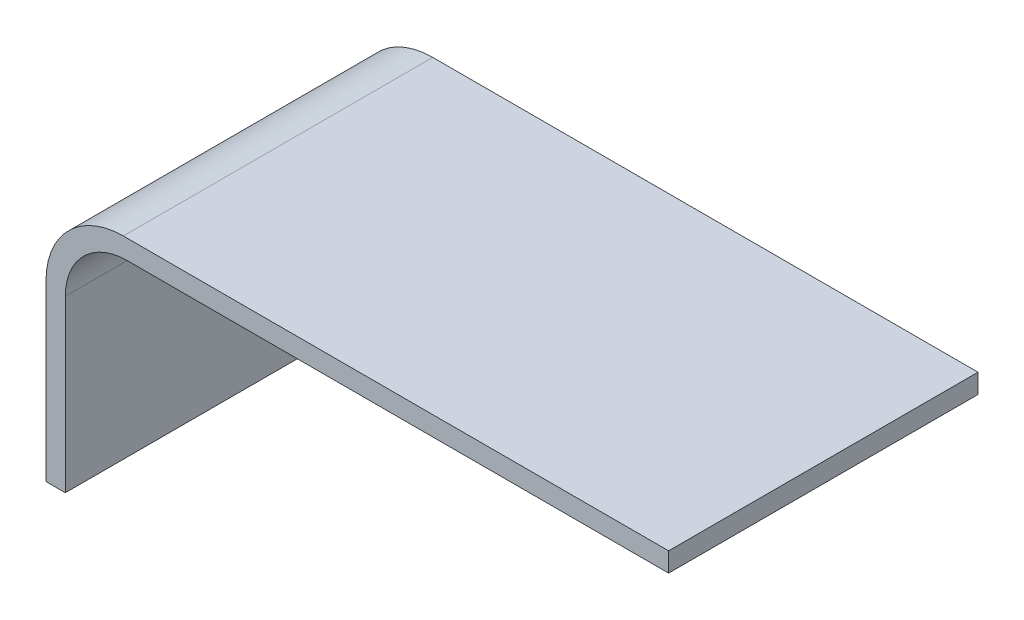
ISO-10303-21;
HEADER;
FILE_DESCRIPTION(('STEP AP214'),'2;1');
FILE_NAME('part.step','',(''),(''),'','','');
FILE_SCHEMA(('AUTOMOTIVE_DESIGN { 1 0 10303 214 1 1 1 1 }'));
ENDSEC;
DATA;
#1=APPLICATION_CONTEXT('core data for automotive mechanical design processes');
#2=APPLICATION_PROTOCOL_DEFINITION('international standard','automotive_design',2000,#1);
#3=PRODUCT_CONTEXT('',#1,'mechanical');
#4=PRODUCT('Part','Part','',(#3));
#5=PRODUCT_RELATED_PRODUCT_CATEGORY('part','',(#4));
#6=PRODUCT_DEFINITION_FORMATION('','',#4);
#7=PRODUCT_DEFINITION_CONTEXT('part definition',#1,'design');
#8=PRODUCT_DEFINITION('design','',#6,#7);
#9=PRODUCT_DEFINITION_SHAPE('','',#8);
#10=(LENGTH_UNIT() NAMED_UNIT(*) SI_UNIT(.MILLI.,.METRE.));
#11=(NAMED_UNIT(*) PLANE_ANGLE_UNIT() SI_UNIT($,.RADIAN.));
#12=(NAMED_UNIT(*) SI_UNIT($,.STERADIAN.) SOLID_ANGLE_UNIT());
#13=UNCERTAINTY_MEASURE_WITH_UNIT(LENGTH_MEASURE(1.E-05),#10,'distance_accuracy_value','');
#14=(GEOMETRIC_REPRESENTATION_CONTEXT(3) GLOBAL_UNCERTAINTY_ASSIGNED_CONTEXT((#13)) GLOBAL_UNIT_ASSIGNED_CONTEXT((#10,
#11,#12)) REPRESENTATION_CONTEXT('',''));
#15=CARTESIAN_POINT('',(0.,0.,0.));
#16=DIRECTION('',(0.,0.,1.));
#17=DIRECTION('',(1.,0.,0.));
#18=AXIS2_PLACEMENT_3D('',#15,#16,#17);
#19=CARTESIAN_POINT('',(204.47,0.,101.6));
#20=DIRECTION('',(-1.,0.,0.));
#21=DIRECTION('',(0.,0.,1.));
#22=AXIS2_PLACEMENT_3D('',#19,#20,#21);
#23=PLANE('',#22);
#24=DIRECTION('',(0.,1.,0.));
#25=VECTOR('',#24,1.);
#26=CARTESIAN_POINT('',(204.47,0.,0.));
#27=LINE('',#26,#25);
#28=CARTESIAN_POINT('',(204.47,-6.35,0.));
#29=VERTEX_POINT('',#28);
#30=CARTESIAN_POINT('',(204.47,0.,0.));
#31=VERTEX_POINT('',#30);
#32=EDGE_CURVE('E145',#29,#31,#27,.T.);
#33=ORIENTED_EDGE('',*,*,#32,.T.);
#34=DIRECTION('',(0.,0.,-1.));
#35=VECTOR('',#34,1.);
#36=CARTESIAN_POINT('',(204.47,0.,101.6));
#37=LINE('',#36,#35);
#38=CARTESIAN_POINT('',(204.47,0.,101.6));
#39=VERTEX_POINT('',#38);
#40=EDGE_CURVE('E11',#39,#31,#37,.T.);
#41=ORIENTED_EDGE('',*,*,#40,.F.);
#42=DIRECTION('',(0.,1.,0.));
#43=VECTOR('',#42,1.);
#44=CARTESIAN_POINT('',(204.47,0.,101.6));
#45=LINE('',#44,#43);
#46=CARTESIAN_POINT('',(204.47,-6.35,101.6));
#47=VERTEX_POINT('',#46);
#48=EDGE_CURVE('E167',#47,#39,#45,.T.);
#49=ORIENTED_EDGE('',*,*,#48,.F.);
#50=DIRECTION('',(0.,0.,-1.));
#51=VECTOR('',#50,1.);
#52=CARTESIAN_POINT('',(204.47,-6.35,101.6));
#53=LINE('',#52,#51);
#54=EDGE_CURVE('E141',#47,#29,#53,.T.);
#55=ORIENTED_EDGE('',*,*,#54,.T.);
#56=EDGE_LOOP('',(#33,#41,#49,#55));
#57=FACE_BOUND('',#56,.T.);
#58=ADVANCED_FACE('F44',(#57),#23,.F.);
#59=CARTESIAN_POINT('',(25.4000000000002,0.,101.6));
#60=DIRECTION('',(0.,-1.,0.));
#61=DIRECTION('',(1.,0.,0.));
#62=AXIS2_PLACEMENT_3D('',#59,#60,#61);
#63=PLANE('',#62);
#64=DIRECTION('',(-1.,0.,0.));
#65=VECTOR('',#64,1.);
#66=CARTESIAN_POINT('',(25.4000000000002,0.,0.));
#67=LINE('',#66,#65);
#68=CARTESIAN_POINT('',(25.4000000000002,0.,0.));
#69=VERTEX_POINT('',#68);
#70=EDGE_CURVE('E149',#31,#69,#67,.T.);
#71=ORIENTED_EDGE('',*,*,#70,.T.);
#72=DIRECTION('',(0.,0.,-1.));
#73=VECTOR('',#72,1.);
#74=CARTESIAN_POINT('',(25.4000000000002,0.,101.6));
#75=LINE('',#74,#73);
#76=CARTESIAN_POINT('',(25.4000000000002,0.,101.6));
#77=VERTEX_POINT('',#76);
#78=EDGE_CURVE('E53',#77,#69,#75,.T.);
#79=ORIENTED_EDGE('',*,*,#78,.F.);
#80=DIRECTION('',(-1.,0.,0.));
#81=VECTOR('',#80,1.);
#82=CARTESIAN_POINT('',(25.4000000000002,0.,101.6));
#83=LINE('',#82,#81);
#84=EDGE_CURVE('E104',#39,#77,#83,.T.);
#85=ORIENTED_EDGE('',*,*,#84,.F.);
#86=ORIENTED_EDGE('',*,*,#40,.T.);
#87=EDGE_LOOP('',(#71,#79,#85,#86));
#88=FACE_BOUND('',#87,.T.);
#89=ADVANCED_FACE('F213',(#88),#63,.F.);
#90=CARTESIAN_POINT('',(25.4,-25.4,101.6));
#91=DIRECTION('',(0.,0.,-1.));
#92=DIRECTION('',(-1.,0.,0.));
#93=AXIS2_PLACEMENT_3D('',#90,#91,#92);
#94=CYLINDRICAL_SURFACE('',#93,25.4);
#95=CARTESIAN_POINT('',(25.4,-25.4,0.));
#96=DIRECTION('',(0.,0.,1.));
#97=DIRECTION('',(-1.,0.,0.));
#98=AXIS2_PLACEMENT_3D('',#95,#96,#97);
#99=CIRCLE('',#98,25.4);
#100=CARTESIAN_POINT('',(0.,-25.4000000000002,0.));
#101=VERTEX_POINT('',#100);
#102=EDGE_CURVE('E152',#69,#101,#99,.T.);
#103=ORIENTED_EDGE('',*,*,#102,.T.);
#104=DIRECTION('',(0.,0.,-1.));
#105=VECTOR('',#104,1.);
#106=CARTESIAN_POINT('',(0.,-25.4000000000002,101.6));
#107=LINE('',#106,#105);
#108=CARTESIAN_POINT('',(0.,-25.4000000000002,101.6));
#109=VERTEX_POINT('',#108);
#110=EDGE_CURVE('E178',#109,#101,#107,.T.);
#111=ORIENTED_EDGE('',*,*,#110,.F.);
#112=CARTESIAN_POINT('',(25.4,-25.4,101.6));
#113=DIRECTION('',(0.,0.,1.));
#114=DIRECTION('',(-1.,0.,0.));
#115=AXIS2_PLACEMENT_3D('',#112,#113,#114);
#116=CIRCLE('',#115,25.4);
#117=EDGE_CURVE('E188',#77,#109,#116,.T.);
#118=ORIENTED_EDGE('',*,*,#117,.F.);
#119=ORIENTED_EDGE('',*,*,#78,.T.);
#120=EDGE_LOOP('',(#103,#111,#118,#119));
#121=FACE_BOUND('',#120,.T.);
#122=ADVANCED_FACE('F186',(#121),#94,.T.);
#123=CARTESIAN_POINT('',(0.,-82.55,101.6));
#124=DIRECTION('',(1.,0.,0.));
#125=DIRECTION('',(0.,1.,0.));
#126=AXIS2_PLACEMENT_3D('',#123,#124,#125);
#127=PLANE('',#126);
#128=DIRECTION('',(0.,-1.,0.));
#129=VECTOR('',#128,1.);
#130=CARTESIAN_POINT('',(0.,-82.55,0.));
#131=LINE('',#130,#129);
#132=CARTESIAN_POINT('',(0.,-82.55,0.));
#133=VERTEX_POINT('',#132);
#134=EDGE_CURVE('E155',#101,#133,#131,.T.);
#135=ORIENTED_EDGE('',*,*,#134,.T.);
#136=DIRECTION('',(0.,0.,-1.));
#137=VECTOR('',#136,1.);
#138=CARTESIAN_POINT('',(0.,-82.55,101.6));
#139=LINE('',#138,#137);
#140=CARTESIAN_POINT('',(0.,-82.55,101.6));
#141=VERTEX_POINT('',#140);
#142=EDGE_CURVE('E174',#141,#133,#139,.T.);
#143=ORIENTED_EDGE('',*,*,#142,.F.);
#144=DIRECTION('',(0.,-1.,0.));
#145=VECTOR('',#144,1.);
#146=CARTESIAN_POINT('',(0.,-82.55,101.6));
#147=LINE('',#146,#145);
#148=EDGE_CURVE('E201',#109,#141,#147,.T.);
#149=ORIENTED_EDGE('',*,*,#148,.F.);
#150=ORIENTED_EDGE('',*,*,#110,.T.);
#151=EDGE_LOOP('',(#135,#143,#149,#150));
#152=FACE_BOUND('',#151,.T.);
#153=ADVANCED_FACE('F196',(#152),#127,.F.);
#154=CARTESIAN_POINT('',(6.35000000000002,-82.55,101.6));
#155=DIRECTION('',(0.,1.,0.));
#156=DIRECTION('',(0.,0.,1.));
#157=AXIS2_PLACEMENT_3D('',#154,#155,#156);
#158=PLANE('',#157);
#159=DIRECTION('',(1.,0.,0.));
#160=VECTOR('',#159,1.);
#161=CARTESIAN_POINT('',(6.35000000000002,-82.55,0.));
#162=LINE('',#161,#160);
#163=CARTESIAN_POINT('',(6.35000000000002,-82.55,0.));
#164=VERTEX_POINT('',#163);
#165=EDGE_CURVE('E158',#133,#164,#162,.T.);
#166=ORIENTED_EDGE('',*,*,#165,.T.);
#167=DIRECTION('',(0.,0.,-1.));
#168=VECTOR('',#167,1.);
#169=CARTESIAN_POINT('',(6.35000000000002,-82.55,101.6));
#170=LINE('',#169,#168);
#171=CARTESIAN_POINT('',(6.35000000000002,-82.55,101.6));
#172=VERTEX_POINT('',#171);
#173=EDGE_CURVE('E134',#172,#164,#170,.T.);
#174=ORIENTED_EDGE('',*,*,#173,.F.);
#175=DIRECTION('',(1.,0.,0.));
#176=VECTOR('',#175,1.);
#177=CARTESIAN_POINT('',(6.35000000000002,-82.55,101.6));
#178=LINE('',#177,#176);
#179=EDGE_CURVE('E123',#141,#172,#178,.T.);
#180=ORIENTED_EDGE('',*,*,#179,.F.);
#181=ORIENTED_EDGE('',*,*,#142,.T.);
#182=EDGE_LOOP('',(#166,#174,#180,#181));
#183=FACE_BOUND('',#182,.T.);
#184=ADVANCED_FACE('F199',(#183),#158,.F.);
#185=CARTESIAN_POINT('',(6.35,-26.67,101.6));
#186=DIRECTION('',(-1.,0.,0.));
#187=DIRECTION('',(0.,-1.,0.));
#188=AXIS2_PLACEMENT_3D('',#185,#186,#187);
#189=PLANE('',#188);
#190=DIRECTION('',(0.,1.,0.));
#191=VECTOR('',#190,1.);
#192=CARTESIAN_POINT('',(6.35,-26.67,0.));
#193=LINE('',#192,#191);
#194=CARTESIAN_POINT('',(6.35,-26.67,0.));
#195=VERTEX_POINT('',#194);
#196=EDGE_CURVE('E132',#164,#195,#193,.T.);
#197=ORIENTED_EDGE('',*,*,#196,.T.);
#198=DIRECTION('',(0.,0.,-1.));
#199=VECTOR('',#198,1.);
#200=CARTESIAN_POINT('',(6.35,-26.67,101.6));
#201=LINE('',#200,#199);
#202=CARTESIAN_POINT('',(6.35,-26.67,101.6));
#203=VERTEX_POINT('',#202);
#204=EDGE_CURVE('E129',#203,#195,#201,.T.);
#205=ORIENTED_EDGE('',*,*,#204,.F.);
#206=DIRECTION('',(0.,1.,0.));
#207=VECTOR('',#206,1.);
#208=CARTESIAN_POINT('',(6.35,-26.67,101.6));
#209=LINE('',#208,#207);
#210=EDGE_CURVE('E117',#172,#203,#209,.T.);
#211=ORIENTED_EDGE('',*,*,#210,.F.);
#212=ORIENTED_EDGE('',*,*,#173,.T.);
#213=EDGE_LOOP('',(#197,#205,#211,#212));
#214=FACE_BOUND('',#213,.T.);
#215=ADVANCED_FACE('F130',(#214),#189,.F.);
#216=CARTESIAN_POINT('',(26.67,-26.67,101.6));
#217=DIRECTION('',(0.,0.,-1.));
#218=DIRECTION('',(-1.,0.,0.));
#219=AXIS2_PLACEMENT_3D('',#216,#217,#218);
#220=CYLINDRICAL_SURFACE('',#219,20.32);
#221=CARTESIAN_POINT('',(26.67,-26.67,0.));
#222=DIRECTION('',(0.,0.,-1.));
#223=DIRECTION('',(-1.,0.,0.));
#224=AXIS2_PLACEMENT_3D('',#221,#222,#223);
#225=CIRCLE('',#224,20.32);
#226=CARTESIAN_POINT('',(26.67,-6.35000000000003,0.));
#227=VERTEX_POINT('',#226);
#228=EDGE_CURVE('E90',#195,#227,#225,.T.);
#229=ORIENTED_EDGE('',*,*,#228,.T.);
#230=DIRECTION('',(0.,0.,-1.));
#231=VECTOR('',#230,1.);
#232=CARTESIAN_POINT('',(26.67,-6.35000000000003,101.6));
#233=LINE('',#232,#231);
#234=CARTESIAN_POINT('',(26.67,-6.35000000000003,101.6));
#235=VERTEX_POINT('',#234);
#236=EDGE_CURVE('E135',#235,#227,#233,.T.);
#237=ORIENTED_EDGE('',*,*,#236,.F.);
#238=CARTESIAN_POINT('',(26.67,-26.67,101.6));
#239=DIRECTION('',(0.,0.,-1.));
#240=DIRECTION('',(-1.,0.,0.));
#241=AXIS2_PLACEMENT_3D('',#238,#239,#240);
#242=CIRCLE('',#241,20.32);
#243=EDGE_CURVE('E121',#203,#235,#242,.T.);
#244=ORIENTED_EDGE('',*,*,#243,.F.);
#245=ORIENTED_EDGE('',*,*,#204,.T.);
#246=EDGE_LOOP('',(#229,#237,#244,#245));
#247=FACE_BOUND('',#246,.T.);
#248=ADVANCED_FACE('F137',(#247),#220,.F.);
#249=CARTESIAN_POINT('',(204.47,-6.35,101.6));
#250=DIRECTION('',(0.,1.,0.));
#251=DIRECTION('',(-1.,0.,0.));
#252=AXIS2_PLACEMENT_3D('',#249,#250,#251);
#253=PLANE('',#252);
#254=DIRECTION('',(1.,0.,0.));
#255=VECTOR('',#254,1.);
#256=CARTESIAN_POINT('',(204.47,-6.35,0.));
#257=LINE('',#256,#255);
#258=EDGE_CURVE('E96',#227,#29,#257,.T.);
#259=ORIENTED_EDGE('',*,*,#258,.T.);
#260=ORIENTED_EDGE('',*,*,#54,.F.);
#261=DIRECTION('',(1.,0.,0.));
#262=VECTOR('',#261,1.);
#263=CARTESIAN_POINT('',(204.47,-6.35,101.6));
#264=LINE('',#263,#262);
#265=EDGE_CURVE('E61',#235,#47,#264,.T.);
#266=ORIENTED_EDGE('',*,*,#265,.F.);
#267=ORIENTED_EDGE('',*,*,#236,.T.);
#268=EDGE_LOOP('',(#259,#260,#266,#267));
#269=FACE_BOUND('',#268,.T.);
#270=ADVANCED_FACE('F229',(#269),#253,.F.);
#271=CARTESIAN_POINT('',(26.67,-26.67,101.6));
#272=DIRECTION('',(0.,0.,-1.));
#273=DIRECTION('',(-1.,0.,0.));
#274=AXIS2_PLACEMENT_3D('',#271,#272,#273);
#275=PLANE('',#274);
#276=ORIENTED_EDGE('',*,*,#48,.T.);
#277=ORIENTED_EDGE('',*,*,#84,.T.);
#278=ORIENTED_EDGE('',*,*,#117,.T.);
#279=ORIENTED_EDGE('',*,*,#148,.T.);
#280=ORIENTED_EDGE('',*,*,#179,.T.);
#281=ORIENTED_EDGE('',*,*,#210,.T.);
#282=ORIENTED_EDGE('',*,*,#243,.T.);
#283=ORIENTED_EDGE('',*,*,#265,.T.);
#284=EDGE_LOOP('',(#276,#277,#278,#279,#280,#281,#282,#283));
#285=FACE_BOUND('',#284,.T.);
#286=ADVANCED_FACE('F119',(#285),#275,.F.);
#287=CARTESIAN_POINT('',(26.67,-26.67,0.));
#288=DIRECTION('',(0.,0.,-1.));
#289=DIRECTION('',(-1.,0.,0.));
#290=AXIS2_PLACEMENT_3D('',#287,#288,#289);
#291=PLANE('',#290);
#292=ORIENTED_EDGE('',*,*,#32,.F.);
#293=ORIENTED_EDGE('',*,*,#258,.F.);
#294=ORIENTED_EDGE('',*,*,#228,.F.);
#295=ORIENTED_EDGE('',*,*,#196,.F.);
#296=ORIENTED_EDGE('',*,*,#165,.F.);
#297=ORIENTED_EDGE('',*,*,#134,.F.);
#298=ORIENTED_EDGE('',*,*,#102,.F.);
#299=ORIENTED_EDGE('',*,*,#70,.F.);
#300=EDGE_LOOP('',(#292,#293,#294,#295,#296,#297,#298,#299));
#301=FACE_BOUND('',#300,.T.);
#302=ADVANCED_FACE('F192',(#301),#291,.T.);
#303=CLOSED_SHELL('',(#58,#89,#122,#153,#184,#215,#248,#270,#286,#302));
#304=MANIFOLD_SOLID_BREP('B2',#303);
#305=ADVANCED_BREP_SHAPE_REPRESENTATION('',(#18,#304),#14);
#306=SHAPE_DEFINITION_REPRESENTATION(#9,#305);
ENDSEC;
END-ISO-10303-21;
